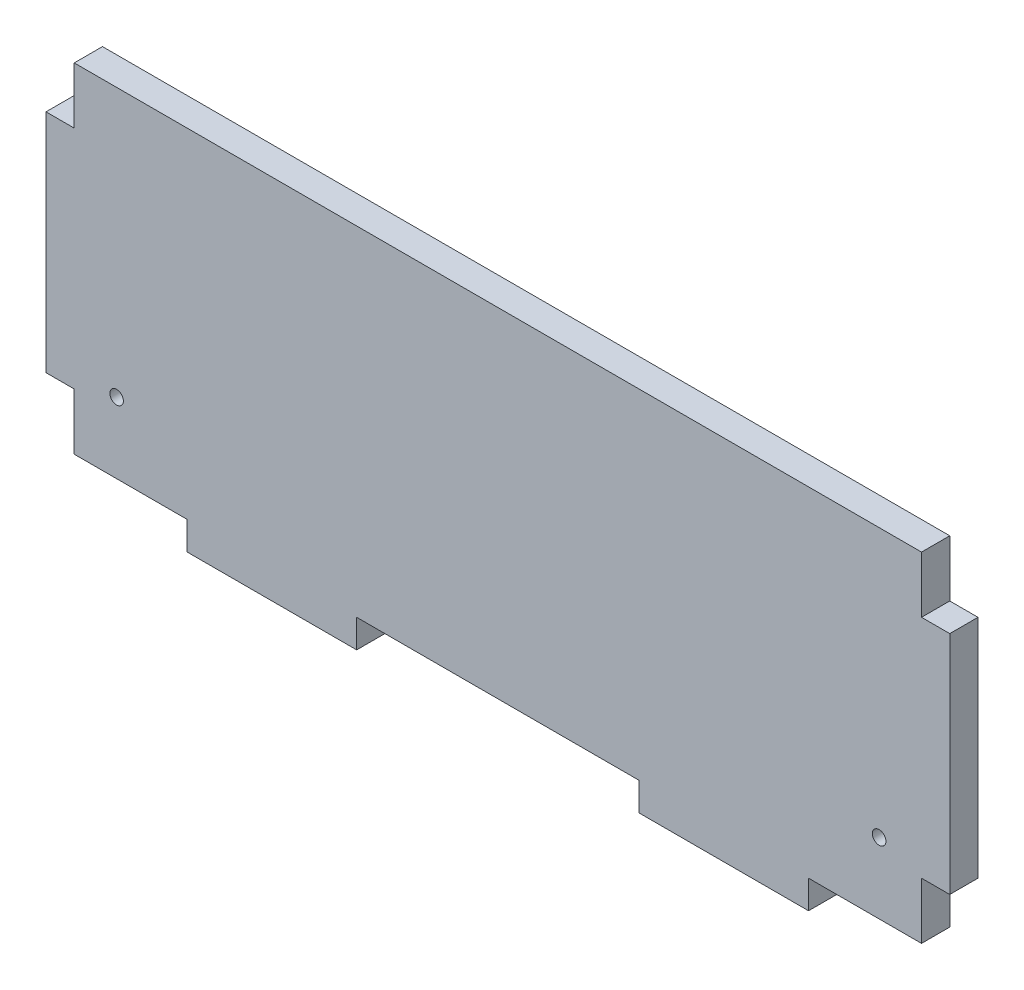
ISO-10303-21;
HEADER;
FILE_DESCRIPTION(('STEP AP214'),'2;1');
FILE_NAME('part.step','',(''),(''),'','','');
FILE_SCHEMA(('AUTOMOTIVE_DESIGN { 1 0 10303 214 1 1 1 1 }'));
ENDSEC;
DATA;
#1=APPLICATION_CONTEXT('core data for automotive mechanical design processes');
#2=APPLICATION_PROTOCOL_DEFINITION('international standard','automotive_design',2000,#1);
#3=PRODUCT_CONTEXT('',#1,'mechanical');
#4=PRODUCT('Part','Part','',(#3));
#5=PRODUCT_RELATED_PRODUCT_CATEGORY('part','',(#4));
#6=PRODUCT_DEFINITION_FORMATION('','',#4);
#7=PRODUCT_DEFINITION_CONTEXT('part definition',#1,'design');
#8=PRODUCT_DEFINITION('design','',#6,#7);
#9=PRODUCT_DEFINITION_SHAPE('','',#8);
#10=(LENGTH_UNIT() NAMED_UNIT(*) SI_UNIT(.MILLI.,.METRE.));
#11=(NAMED_UNIT(*) PLANE_ANGLE_UNIT() SI_UNIT($,.RADIAN.));
#12=(NAMED_UNIT(*) SI_UNIT($,.STERADIAN.) SOLID_ANGLE_UNIT());
#13=UNCERTAINTY_MEASURE_WITH_UNIT(LENGTH_MEASURE(1.E-05),#10,'distance_accuracy_value','');
#14=(GEOMETRIC_REPRESENTATION_CONTEXT(3) GLOBAL_UNCERTAINTY_ASSIGNED_CONTEXT((#13)) GLOBAL_UNIT_ASSIGNED_CONTEXT((#10,
#11,#12)) REPRESENTATION_CONTEXT('',''));
#15=CARTESIAN_POINT('',(0.,0.,0.));
#16=DIRECTION('',(0.,0.,1.));
#17=DIRECTION('',(1.,0.,0.));
#18=AXIS2_PLACEMENT_3D('',#15,#16,#17);
#19=CARTESIAN_POINT('',(-95.25,-38.1,6.35));
#20=DIRECTION('',(0.,1.,0.));
#21=DIRECTION('',(0.,0.,1.));
#22=AXIS2_PLACEMENT_3D('',#19,#20,#21);
#23=PLANE('',#22);
#24=DIRECTION('',(0.,0.,-1.));
#25=VECTOR('',#24,1.);
#26=CARTESIAN_POINT('',(31.75,-38.1,6.35));
#27=LINE('',#26,#25);
#28=CARTESIAN_POINT('',(31.75,-38.1,6.35));
#29=VERTEX_POINT('',#28);
#30=CARTESIAN_POINT('',(31.75,-38.1,0.));
#31=VERTEX_POINT('',#30);
#32=EDGE_CURVE('E60',#29,#31,#27,.T.);
#33=ORIENTED_EDGE('',*,*,#32,.F.);
#34=DIRECTION('',(1.,0.,0.));
#35=VECTOR('',#34,1.);
#36=CARTESIAN_POINT('',(-95.25,-38.1,6.35));
#37=LINE('',#36,#35);
#38=CARTESIAN_POINT('',(-31.75,-38.1,6.35));
#39=VERTEX_POINT('',#38);
#40=EDGE_CURVE('E395',#39,#29,#37,.T.);
#41=ORIENTED_EDGE('',*,*,#40,.F.);
#42=DIRECTION('',(0.,0.,1.));
#43=VECTOR('',#42,1.);
#44=CARTESIAN_POINT('',(-31.75,-38.1,6.35));
#45=LINE('',#44,#43);
#46=CARTESIAN_POINT('',(-31.75,-38.1,0.));
#47=VERTEX_POINT('',#46);
#48=EDGE_CURVE('E202',#47,#39,#45,.T.);
#49=ORIENTED_EDGE('',*,*,#48,.F.);
#50=DIRECTION('',(1.,0.,0.));
#51=VECTOR('',#50,1.);
#52=CARTESIAN_POINT('',(-95.25,-38.1,0.));
#53=LINE('',#52,#51);
#54=EDGE_CURVE('E232',#47,#31,#53,.T.);
#55=ORIENTED_EDGE('',*,*,#54,.T.);
#56=EDGE_LOOP('',(#33,#41,#49,#55));
#57=FACE_BOUND('',#56,.T.);
#58=ADVANCED_FACE('F35',(#57),#23,.F.);
#59=DIRECTION('',(0.,0.,1.));
#60=VECTOR('',#59,1.);
#61=CARTESIAN_POINT('',(69.85,-38.1,6.35));
#62=LINE('',#61,#60);
#63=CARTESIAN_POINT('',(69.85,-38.1,0.));
#64=VERTEX_POINT('',#63);
#65=CARTESIAN_POINT('',(69.85,-38.1,6.35));
#66=VERTEX_POINT('',#65);
#67=EDGE_CURVE('E196',#64,#66,#62,.T.);
#68=ORIENTED_EDGE('',*,*,#67,.F.);
#69=CARTESIAN_POINT('',(95.25,-38.1,0.));
#70=VERTEX_POINT('',#69);
#71=EDGE_CURVE('E230',#64,#70,#53,.T.);
#72=ORIENTED_EDGE('',*,*,#71,.T.);
#73=DIRECTION('',(0.,0.,-1.));
#74=VECTOR('',#73,1.);
#75=CARTESIAN_POINT('',(95.25,-38.1,6.35));
#76=LINE('',#75,#74);
#77=CARTESIAN_POINT('',(95.25,-38.1,6.35));
#78=VERTEX_POINT('',#77);
#79=EDGE_CURVE('E239',#78,#70,#76,.T.);
#80=ORIENTED_EDGE('',*,*,#79,.F.);
#81=EDGE_CURVE('E39',#66,#78,#37,.T.);
#82=ORIENTED_EDGE('',*,*,#81,.F.);
#83=EDGE_LOOP('',(#68,#72,#80,#82));
#84=FACE_BOUND('',#83,.T.);
#85=ADVANCED_FACE('F436',(#84),#23,.F.);
#86=DIRECTION('',(0.,0.,-1.));
#87=VECTOR('',#86,1.);
#88=CARTESIAN_POINT('',(-69.85,-38.1,6.35));
#89=LINE('',#88,#87);
#90=CARTESIAN_POINT('',(-69.85,-38.1,6.35));
#91=VERTEX_POINT('',#90);
#92=CARTESIAN_POINT('',(-69.85,-38.1,0.));
#93=VERTEX_POINT('',#92);
#94=EDGE_CURVE('E199',#91,#93,#89,.T.);
#95=ORIENTED_EDGE('',*,*,#94,.F.);
#96=CARTESIAN_POINT('',(-95.25,-38.1,6.35));
#97=VERTEX_POINT('',#96);
#98=EDGE_CURVE('E391',#97,#91,#37,.T.);
#99=ORIENTED_EDGE('',*,*,#98,.F.);
#100=DIRECTION('',(0.,0.,-1.));
#101=VECTOR('',#100,1.);
#102=CARTESIAN_POINT('',(-95.25,-38.1,6.35));
#103=LINE('',#102,#101);
#104=CARTESIAN_POINT('',(-95.25,-38.1,0.));
#105=VERTEX_POINT('',#104);
#106=EDGE_CURVE('E390',#97,#105,#103,.T.);
#107=ORIENTED_EDGE('',*,*,#106,.T.);
#108=EDGE_CURVE('E246',#105,#93,#53,.T.);
#109=ORIENTED_EDGE('',*,*,#108,.T.);
#110=EDGE_LOOP('',(#95,#99,#107,#109));
#111=FACE_BOUND('',#110,.T.);
#112=ADVANCED_FACE('F387',(#111),#23,.F.);
#113=CARTESIAN_POINT('',(95.25,-38.1,6.35));
#114=DIRECTION('',(-1.,0.,0.));
#115=DIRECTION('',(0.,0.,1.));
#116=AXIS2_PLACEMENT_3D('',#113,#114,#115);
#117=PLANE('',#116);
#118=DIRECTION('',(0.,0.,1.));
#119=VECTOR('',#118,1.);
#120=CARTESIAN_POINT('',(95.25,25.4,6.35));
#121=LINE('',#120,#119);
#122=CARTESIAN_POINT('',(95.25,25.3999999999999,0.));
#123=VERTEX_POINT('',#122);
#124=CARTESIAN_POINT('',(95.25,25.3999999999999,6.35));
#125=VERTEX_POINT('',#124);
#126=EDGE_CURVE('E261',#123,#125,#121,.T.);
#127=ORIENTED_EDGE('',*,*,#126,.F.);
#128=DIRECTION('',(0.,1.,0.));
#129=VECTOR('',#128,1.);
#130=CARTESIAN_POINT('',(95.25,-38.1,0.));
#131=LINE('',#130,#129);
#132=CARTESIAN_POINT('',(95.25,38.1,0.));
#133=VERTEX_POINT('',#132);
#134=EDGE_CURVE('E307',#123,#133,#131,.T.);
#135=ORIENTED_EDGE('',*,*,#134,.T.);
#136=DIRECTION('',(0.,0.,-1.));
#137=VECTOR('',#136,1.);
#138=CARTESIAN_POINT('',(95.25,38.1,6.35));
#139=LINE('',#138,#137);
#140=CARTESIAN_POINT('',(95.25,38.1,6.35));
#141=VERTEX_POINT('',#140);
#142=EDGE_CURVE('E11',#141,#133,#139,.T.);
#143=ORIENTED_EDGE('',*,*,#142,.F.);
#144=DIRECTION('',(0.,1.,0.));
#145=VECTOR('',#144,1.);
#146=CARTESIAN_POINT('',(95.25,-38.1,6.35));
#147=LINE('',#146,#145);
#148=EDGE_CURVE('E248',#125,#141,#147,.T.);
#149=ORIENTED_EDGE('',*,*,#148,.F.);
#150=EDGE_LOOP('',(#127,#135,#143,#149));
#151=FACE_BOUND('',#150,.T.);
#152=ADVANCED_FACE('F37',(#151),#117,.F.);
#153=DIRECTION('',(0.,0.,-1.));
#154=VECTOR('',#153,1.);
#155=CARTESIAN_POINT('',(95.25,-25.4,6.35));
#156=LINE('',#155,#154);
#157=CARTESIAN_POINT('',(95.25,-25.4,6.35));
#158=VERTEX_POINT('',#157);
#159=CARTESIAN_POINT('',(95.25,-25.4,0.));
#160=VERTEX_POINT('',#159);
#161=EDGE_CURVE('E266',#158,#160,#156,.T.);
#162=ORIENTED_EDGE('',*,*,#161,.F.);
#163=EDGE_CURVE('E345',#78,#158,#147,.T.);
#164=ORIENTED_EDGE('',*,*,#163,.F.);
#165=ORIENTED_EDGE('',*,*,#79,.T.);
#166=EDGE_CURVE('E320',#70,#160,#131,.T.);
#167=ORIENTED_EDGE('',*,*,#166,.T.);
#168=EDGE_LOOP('',(#162,#164,#165,#167));
#169=FACE_BOUND('',#168,.T.);
#170=ADVANCED_FACE('F428',(#169),#117,.F.);
#171=CARTESIAN_POINT('',(-95.25,-38.1,6.35));
#172=DIRECTION('',(1.,0.,0.));
#173=DIRECTION('',(0.,0.,-1.));
#174=AXIS2_PLACEMENT_3D('',#171,#172,#173);
#175=PLANE('',#174);
#176=DIRECTION('',(0.,0.,-1.));
#177=VECTOR('',#176,1.);
#178=CARTESIAN_POINT('',(-95.25,25.4,0.));
#179=LINE('',#178,#177);
#180=CARTESIAN_POINT('',(-95.25,25.3999999999999,6.35));
#181=VERTEX_POINT('',#180);
#182=CARTESIAN_POINT('',(-95.25,25.3999999999999,0.));
#183=VERTEX_POINT('',#182);
#184=EDGE_CURVE('E278',#181,#183,#179,.T.);
#185=ORIENTED_EDGE('',*,*,#184,.F.);
#186=DIRECTION('',(0.,-1.,0.));
#187=VECTOR('',#186,1.);
#188=CARTESIAN_POINT('',(-95.25,-38.1,6.35));
#189=LINE('',#188,#187);
#190=CARTESIAN_POINT('',(-95.25,38.1,6.35));
#191=VERTEX_POINT('',#190);
#192=EDGE_CURVE('E339',#191,#181,#189,.T.);
#193=ORIENTED_EDGE('',*,*,#192,.F.);
#194=DIRECTION('',(0.,0.,-1.));
#195=VECTOR('',#194,1.);
#196=CARTESIAN_POINT('',(-95.25,38.1,6.35));
#197=LINE('',#196,#195);
#198=CARTESIAN_POINT('',(-95.25,38.1,0.));
#199=VERTEX_POINT('',#198);
#200=EDGE_CURVE('E45',#191,#199,#197,.T.);
#201=ORIENTED_EDGE('',*,*,#200,.T.);
#202=DIRECTION('',(0.,-1.,0.));
#203=VECTOR('',#202,1.);
#204=CARTESIAN_POINT('',(-95.25,-38.1,0.));
#205=LINE('',#204,#203);
#206=EDGE_CURVE('E233',#199,#183,#205,.T.);
#207=ORIENTED_EDGE('',*,*,#206,.T.);
#208=EDGE_LOOP('',(#185,#193,#201,#207));
#209=FACE_BOUND('',#208,.T.);
#210=ADVANCED_FACE('F369',(#209),#175,.F.);
#211=DIRECTION('',(0.,0.,1.));
#212=VECTOR('',#211,1.);
#213=CARTESIAN_POINT('',(-95.25,-25.4,0.));
#214=LINE('',#213,#212);
#215=CARTESIAN_POINT('',(-95.25,-25.4,0.));
#216=VERTEX_POINT('',#215);
#217=CARTESIAN_POINT('',(-95.25,-25.4,6.35));
#218=VERTEX_POINT('',#217);
#219=EDGE_CURVE('E290',#216,#218,#214,.T.);
#220=ORIENTED_EDGE('',*,*,#219,.F.);
#221=EDGE_CURVE('E328',#216,#105,#205,.T.);
#222=ORIENTED_EDGE('',*,*,#221,.T.);
#223=ORIENTED_EDGE('',*,*,#106,.F.);
#224=EDGE_CURVE('E295',#218,#97,#189,.T.);
#225=ORIENTED_EDGE('',*,*,#224,.F.);
#226=EDGE_LOOP('',(#220,#222,#223,#225));
#227=FACE_BOUND('',#226,.T.);
#228=ADVANCED_FACE('F381',(#227),#175,.F.);
#229=CARTESIAN_POINT('',(-95.25,38.1,6.35));
#230=DIRECTION('',(0.,-1.,0.));
#231=DIRECTION('',(0.,0.,-1.));
#232=AXIS2_PLACEMENT_3D('',#229,#230,#231);
#233=PLANE('',#232);
#234=DIRECTION('',(-1.,0.,0.));
#235=VECTOR('',#234,1.);
#236=CARTESIAN_POINT('',(-95.25,38.1,0.));
#237=LINE('',#236,#235);
#238=EDGE_CURVE('E323',#133,#199,#237,.T.);
#239=ORIENTED_EDGE('',*,*,#238,.T.);
#240=ORIENTED_EDGE('',*,*,#200,.F.);
#241=DIRECTION('',(-1.,0.,0.));
#242=VECTOR('',#241,1.);
#243=CARTESIAN_POINT('',(-95.25,38.1,6.35));
#244=LINE('',#243,#242);
#245=EDGE_CURVE('E343',#141,#191,#244,.T.);
#246=ORIENTED_EDGE('',*,*,#245,.F.);
#247=ORIENTED_EDGE('',*,*,#142,.T.);
#248=EDGE_LOOP('',(#239,#240,#246,#247));
#249=FACE_BOUND('',#248,.T.);
#250=ADVANCED_FACE('F361',(#249),#233,.F.);
#251=CARTESIAN_POINT('',(0.,0.,6.35));
#252=DIRECTION('',(0.,0.,-1.));
#253=DIRECTION('',(-1.,0.,0.));
#254=AXIS2_PLACEMENT_3D('',#251,#252,#253);
#255=PLANE('',#254);
#256=CARTESIAN_POINT('',(-85.725,-22.225,6.35));
#257=DIRECTION('',(0.,0.,-1.));
#258=DIRECTION('',(-1.,0.,0.));
#259=AXIS2_PLACEMENT_3D('',#256,#257,#258);
#260=CIRCLE('',#259,1.52399999999999);
#261=CARTESIAN_POINT('',(-87.249,-22.225,6.35));
#262=VERTEX_POINT('',#261);
#263=EDGE_CURVE('E655',#262,#262,#260,.T.);
#264=ORIENTED_EDGE('',*,*,#263,.T.);
#265=EDGE_LOOP('',(#264));
#266=FACE_BOUND('',#265,.T.);
#267=CARTESIAN_POINT('',(85.725,-22.225,6.35));
#268=DIRECTION('',(0.,0.,-1.));
#269=DIRECTION('',(-1.,0.,0.));
#270=AXIS2_PLACEMENT_3D('',#267,#268,#269);
#271=CIRCLE('',#270,1.52399999999999);
#272=CARTESIAN_POINT('',(84.201,-22.225,6.35));
#273=VERTEX_POINT('',#272);
#274=EDGE_CURVE('E663',#273,#273,#271,.T.);
#275=ORIENTED_EDGE('',*,*,#274,.T.);
#276=EDGE_LOOP('',(#275));
#277=FACE_BOUND('',#276,.T.);
#278=ORIENTED_EDGE('',*,*,#163,.T.);
#279=DIRECTION('',(-1.,0.,0.));
#280=VECTOR('',#279,1.);
#281=CARTESIAN_POINT('',(101.6,-25.4,6.35));
#282=LINE('',#281,#280);
#283=CARTESIAN_POINT('',(101.6,-25.4,6.35));
#284=VERTEX_POINT('',#283);
#285=EDGE_CURVE('E294',#284,#158,#282,.T.);
#286=ORIENTED_EDGE('',*,*,#285,.F.);
#287=DIRECTION('',(0.,-1.,0.));
#288=VECTOR('',#287,1.);
#289=CARTESIAN_POINT('',(101.6,25.4,6.35));
#290=LINE('',#289,#288);
#291=CARTESIAN_POINT('',(101.6,25.4,6.35));
#292=VERTEX_POINT('',#291);
#293=EDGE_CURVE('E265',#292,#284,#290,.T.);
#294=ORIENTED_EDGE('',*,*,#293,.F.);
#295=DIRECTION('',(-1.,0.,0.));
#296=VECTOR('',#295,1.);
#297=CARTESIAN_POINT('',(101.6,25.4,6.35));
#298=LINE('',#297,#296);
#299=EDGE_CURVE('E255',#292,#125,#298,.T.);
#300=ORIENTED_EDGE('',*,*,#299,.T.);
#301=ORIENTED_EDGE('',*,*,#148,.T.);
#302=ORIENTED_EDGE('',*,*,#245,.T.);
#303=ORIENTED_EDGE('',*,*,#192,.T.);
#304=DIRECTION('',(1.,0.,0.));
#305=VECTOR('',#304,1.);
#306=CARTESIAN_POINT('',(-101.6,25.4,6.35));
#307=LINE('',#306,#305);
#308=CARTESIAN_POINT('',(-101.6,25.4,6.35));
#309=VERTEX_POINT('',#308);
#310=EDGE_CURVE('E302',#309,#181,#307,.T.);
#311=ORIENTED_EDGE('',*,*,#310,.F.);
#312=DIRECTION('',(0.,1.,0.));
#313=VECTOR('',#312,1.);
#314=CARTESIAN_POINT('',(-101.6,25.4,6.35));
#315=LINE('',#314,#313);
#316=CARTESIAN_POINT('',(-101.6,-25.4,6.35));
#317=VERTEX_POINT('',#316);
#318=EDGE_CURVE('E280',#317,#309,#315,.T.);
#319=ORIENTED_EDGE('',*,*,#318,.F.);
#320=DIRECTION('',(1.,0.,0.));
#321=VECTOR('',#320,1.);
#322=CARTESIAN_POINT('',(-101.6,-25.4,6.35));
#323=LINE('',#322,#321);
#324=EDGE_CURVE('E298',#317,#218,#323,.T.);
#325=ORIENTED_EDGE('',*,*,#324,.T.);
#326=ORIENTED_EDGE('',*,*,#224,.T.);
#327=ORIENTED_EDGE('',*,*,#98,.T.);
#328=DIRECTION('',(0.,1.,0.));
#329=VECTOR('',#328,1.);
#330=CARTESIAN_POINT('',(-69.85,-44.45,6.35));
#331=LINE('',#330,#329);
#332=CARTESIAN_POINT('',(-69.85,-44.45,6.35));
#333=VERTEX_POINT('',#332);
#334=EDGE_CURVE('E217',#333,#91,#331,.T.);
#335=ORIENTED_EDGE('',*,*,#334,.F.);
#336=DIRECTION('',(-1.,0.,0.));
#337=VECTOR('',#336,1.);
#338=CARTESIAN_POINT('',(-69.85,-44.45,6.35));
#339=LINE('',#338,#337);
#340=CARTESIAN_POINT('',(-31.75,-44.45,6.35));
#341=VERTEX_POINT('',#340);
#342=EDGE_CURVE('E215',#341,#333,#339,.T.);
#343=ORIENTED_EDGE('',*,*,#342,.F.);
#344=DIRECTION('',(0.,1.,0.));
#345=VECTOR('',#344,1.);
#346=CARTESIAN_POINT('',(-31.75,-44.45,6.35));
#347=LINE('',#346,#345);
#348=EDGE_CURVE('E228',#341,#39,#347,.T.);
#349=ORIENTED_EDGE('',*,*,#348,.T.);
#350=ORIENTED_EDGE('',*,*,#40,.T.);
#351=DIRECTION('',(0.,1.,0.));
#352=VECTOR('',#351,1.);
#353=CARTESIAN_POINT('',(31.75,-44.45,6.35));
#354=LINE('',#353,#352);
#355=CARTESIAN_POINT('',(31.75,-44.45,6.35));
#356=VERTEX_POINT('',#355);
#357=EDGE_CURVE('E670',#356,#29,#354,.T.);
#358=ORIENTED_EDGE('',*,*,#357,.F.);
#359=DIRECTION('',(-1.,0.,0.));
#360=VECTOR('',#359,1.);
#361=CARTESIAN_POINT('',(31.75,-44.45,6.35));
#362=LINE('',#361,#360);
#363=CARTESIAN_POINT('',(69.85,-44.45,6.35));
#364=VERTEX_POINT('',#363);
#365=EDGE_CURVE('E192',#364,#356,#362,.T.);
#366=ORIENTED_EDGE('',*,*,#365,.F.);
#367=DIRECTION('',(0.,1.,0.));
#368=VECTOR('',#367,1.);
#369=CARTESIAN_POINT('',(69.85,-44.45,6.35));
#370=LINE('',#369,#368);
#371=EDGE_CURVE('E204',#364,#66,#370,.T.);
#372=ORIENTED_EDGE('',*,*,#371,.T.);
#373=ORIENTED_EDGE('',*,*,#81,.T.);
#374=EDGE_LOOP('',(#278,#286,#294,#300,#301,#302,#303,#311,#319,#325,#326,#327,#335,#343,#349,
#350,#358,#366,#372,#373));
#375=FACE_BOUND('',#374,.T.);
#376=ADVANCED_FACE('F356',(#266,#277,#375),#255,.F.);
#377=CARTESIAN_POINT('',(0.,0.,0.));
#378=DIRECTION('',(0.,0.,-1.));
#379=DIRECTION('',(-1.,0.,0.));
#380=AXIS2_PLACEMENT_3D('',#377,#378,#379);
#381=PLANE('',#380);
#382=CARTESIAN_POINT('',(-85.725,-22.225,0.));
#383=DIRECTION('',(0.,0.,-1.));
#384=DIRECTION('',(-1.,0.,0.));
#385=AXIS2_PLACEMENT_3D('',#382,#383,#384);
#386=CIRCLE('',#385,1.52399999999999);
#387=CARTESIAN_POINT('',(-87.249,-22.225,0.));
#388=VERTEX_POINT('',#387);
#389=EDGE_CURVE('E658',#388,#388,#386,.T.);
#390=ORIENTED_EDGE('',*,*,#389,.F.);
#391=EDGE_LOOP('',(#390));
#392=FACE_BOUND('',#391,.T.);
#393=CARTESIAN_POINT('',(85.725,-22.225,0.));
#394=DIRECTION('',(0.,0.,-1.));
#395=DIRECTION('',(-1.,0.,0.));
#396=AXIS2_PLACEMENT_3D('',#393,#394,#395);
#397=CIRCLE('',#396,1.52399999999999);
#398=CARTESIAN_POINT('',(84.201,-22.225,0.));
#399=VERTEX_POINT('',#398);
#400=EDGE_CURVE('E660',#399,#399,#397,.T.);
#401=ORIENTED_EDGE('',*,*,#400,.F.);
#402=EDGE_LOOP('',(#401));
#403=FACE_BOUND('',#402,.T.);
#404=ORIENTED_EDGE('',*,*,#166,.F.);
#405=ORIENTED_EDGE('',*,*,#71,.F.);
#406=DIRECTION('',(0.,1.,0.));
#407=VECTOR('',#406,1.);
#408=CARTESIAN_POINT('',(69.85,-44.45,0.));
#409=LINE('',#408,#407);
#410=CARTESIAN_POINT('',(69.85,-44.45,0.));
#411=VERTEX_POINT('',#410);
#412=EDGE_CURVE('E183',#411,#64,#409,.T.);
#413=ORIENTED_EDGE('',*,*,#412,.F.);
#414=DIRECTION('',(1.,0.,0.));
#415=VECTOR('',#414,1.);
#416=CARTESIAN_POINT('',(31.75,-44.45,0.));
#417=LINE('',#416,#415);
#418=CARTESIAN_POINT('',(31.75,-44.45,0.));
#419=VERTEX_POINT('',#418);
#420=EDGE_CURVE('E175',#419,#411,#417,.T.);
#421=ORIENTED_EDGE('',*,*,#420,.F.);
#422=DIRECTION('',(0.,1.,0.));
#423=VECTOR('',#422,1.);
#424=CARTESIAN_POINT('',(31.75,-44.45,0.));
#425=LINE('',#424,#423);
#426=EDGE_CURVE('E181',#419,#31,#425,.T.);
#427=ORIENTED_EDGE('',*,*,#426,.T.);
#428=ORIENTED_EDGE('',*,*,#54,.F.);
#429=DIRECTION('',(0.,1.,0.));
#430=VECTOR('',#429,1.);
#431=CARTESIAN_POINT('',(-31.75,-44.45,0.));
#432=LINE('',#431,#430);
#433=CARTESIAN_POINT('',(-31.75,-44.45,0.));
#434=VERTEX_POINT('',#433);
#435=EDGE_CURVE('E403',#434,#47,#432,.T.);
#436=ORIENTED_EDGE('',*,*,#435,.F.);
#437=DIRECTION('',(1.,0.,0.));
#438=VECTOR('',#437,1.);
#439=CARTESIAN_POINT('',(-69.85,-44.45,0.));
#440=LINE('',#439,#438);
#441=CARTESIAN_POINT('',(-69.85,-44.45,0.));
#442=VERTEX_POINT('',#441);
#443=EDGE_CURVE('E211',#442,#434,#440,.T.);
#444=ORIENTED_EDGE('',*,*,#443,.F.);
#445=DIRECTION('',(0.,1.,0.));
#446=VECTOR('',#445,1.);
#447=CARTESIAN_POINT('',(-69.85,-44.45,0.));
#448=LINE('',#447,#446);
#449=EDGE_CURVE('E385',#442,#93,#448,.T.);
#450=ORIENTED_EDGE('',*,*,#449,.T.);
#451=ORIENTED_EDGE('',*,*,#108,.F.);
#452=ORIENTED_EDGE('',*,*,#221,.F.);
#453=DIRECTION('',(1.,0.,0.));
#454=VECTOR('',#453,1.);
#455=CARTESIAN_POINT('',(-101.6,-25.4,0.));
#456=LINE('',#455,#454);
#457=CARTESIAN_POINT('',(-101.6,-25.4,0.));
#458=VERTEX_POINT('',#457);
#459=EDGE_CURVE('E301',#458,#216,#456,.T.);
#460=ORIENTED_EDGE('',*,*,#459,.F.);
#461=DIRECTION('',(0.,-1.,0.));
#462=VECTOR('',#461,1.);
#463=CARTESIAN_POINT('',(-101.6,25.4,0.));
#464=LINE('',#463,#462);
#465=CARTESIAN_POINT('',(-101.6,25.4,0.));
#466=VERTEX_POINT('',#465);
#467=EDGE_CURVE('E274',#466,#458,#464,.T.);
#468=ORIENTED_EDGE('',*,*,#467,.F.);
#469=DIRECTION('',(1.,0.,0.));
#470=VECTOR('',#469,1.);
#471=CARTESIAN_POINT('',(-101.6,25.4,0.));
#472=LINE('',#471,#470);
#473=EDGE_CURVE('E284',#466,#183,#472,.T.);
#474=ORIENTED_EDGE('',*,*,#473,.T.);
#475=ORIENTED_EDGE('',*,*,#206,.F.);
#476=ORIENTED_EDGE('',*,*,#238,.F.);
#477=ORIENTED_EDGE('',*,*,#134,.F.);
#478=DIRECTION('',(-1.,0.,0.));
#479=VECTOR('',#478,1.);
#480=CARTESIAN_POINT('',(101.6,25.4,0.));
#481=LINE('',#480,#479);
#482=CARTESIAN_POINT('',(101.6,25.4,0.));
#483=VERTEX_POINT('',#482);
#484=EDGE_CURVE('E251',#483,#123,#481,.T.);
#485=ORIENTED_EDGE('',*,*,#484,.F.);
#486=DIRECTION('',(0.,1.,0.));
#487=VECTOR('',#486,1.);
#488=CARTESIAN_POINT('',(101.6,25.4,0.));
#489=LINE('',#488,#487);
#490=CARTESIAN_POINT('',(101.6,-25.4,0.));
#491=VERTEX_POINT('',#490);
#492=EDGE_CURVE('E420',#491,#483,#489,.T.);
#493=ORIENTED_EDGE('',*,*,#492,.F.);
#494=DIRECTION('',(-1.,0.,0.));
#495=VECTOR('',#494,1.);
#496=CARTESIAN_POINT('',(101.6,-25.4,0.));
#497=LINE('',#496,#495);
#498=EDGE_CURVE('E254',#491,#160,#497,.T.);
#499=ORIENTED_EDGE('',*,*,#498,.T.);
#500=EDGE_LOOP('',(#404,#405,#413,#421,#427,#428,#436,#444,#450,#451,#452,#460,#468,#474,#475,
#476,#477,#485,#493,#499));
#501=FACE_BOUND('',#500,.T.);
#502=ADVANCED_FACE('F178',(#392,#403,#501),#381,.T.);
#503=CARTESIAN_POINT('',(-101.6,-25.4,0.));
#504=DIRECTION('',(0.,1.,0.));
#505=DIRECTION('',(0.,0.,1.));
#506=AXIS2_PLACEMENT_3D('',#503,#504,#505);
#507=PLANE('',#506);
#508=ORIENTED_EDGE('',*,*,#219,.T.);
#509=ORIENTED_EDGE('',*,*,#324,.F.);
#510=DIRECTION('',(0.,0.,1.));
#511=VECTOR('',#510,1.);
#512=CARTESIAN_POINT('',(-101.6,-25.4,0.));
#513=LINE('',#512,#511);
#514=EDGE_CURVE('E277',#458,#317,#513,.T.);
#515=ORIENTED_EDGE('',*,*,#514,.F.);
#516=ORIENTED_EDGE('',*,*,#459,.T.);
#517=EDGE_LOOP('',(#508,#509,#515,#516));
#518=FACE_BOUND('',#517,.T.);
#519=ADVANCED_FACE('F380',(#518),#507,.F.);
#520=CARTESIAN_POINT('',(-101.6,25.4,0.));
#521=DIRECTION('',(0.,-1.,0.));
#522=DIRECTION('',(0.,0.,-1.));
#523=AXIS2_PLACEMENT_3D('',#520,#521,#522);
#524=PLANE('',#523);
#525=ORIENTED_EDGE('',*,*,#184,.T.);
#526=ORIENTED_EDGE('',*,*,#473,.F.);
#527=DIRECTION('',(0.,0.,-1.));
#528=VECTOR('',#527,1.);
#529=CARTESIAN_POINT('',(-101.6,25.4,0.));
#530=LINE('',#529,#528);
#531=EDGE_CURVE('E282',#309,#466,#530,.T.);
#532=ORIENTED_EDGE('',*,*,#531,.F.);
#533=ORIENTED_EDGE('',*,*,#310,.T.);
#534=EDGE_LOOP('',(#525,#526,#532,#533));
#535=FACE_BOUND('',#534,.T.);
#536=ADVANCED_FACE('F371',(#535),#524,.F.);
#537=CARTESIAN_POINT('',(-101.6,0.,0.));
#538=DIRECTION('',(-1.,0.,0.));
#539=DIRECTION('',(0.,0.,1.));
#540=AXIS2_PLACEMENT_3D('',#537,#538,#539);
#541=PLANE('',#540);
#542=ORIENTED_EDGE('',*,*,#467,.T.);
#543=ORIENTED_EDGE('',*,*,#514,.T.);
#544=ORIENTED_EDGE('',*,*,#318,.T.);
#545=ORIENTED_EDGE('',*,*,#531,.T.);
#546=EDGE_LOOP('',(#542,#543,#544,#545));
#547=FACE_BOUND('',#546,.T.);
#548=ADVANCED_FACE('F377',(#547),#541,.T.);
#549=CARTESIAN_POINT('',(101.6,-25.4,6.35));
#550=DIRECTION('',(0.,1.,0.));
#551=DIRECTION('',(0.,0.,1.));
#552=AXIS2_PLACEMENT_3D('',#549,#550,#551);
#553=PLANE('',#552);
#554=ORIENTED_EDGE('',*,*,#161,.T.);
#555=ORIENTED_EDGE('',*,*,#498,.F.);
#556=DIRECTION('',(0.,0.,-1.));
#557=VECTOR('',#556,1.);
#558=CARTESIAN_POINT('',(101.6,-25.4,6.35));
#559=LINE('',#558,#557);
#560=EDGE_CURVE('E417',#284,#491,#559,.T.);
#561=ORIENTED_EDGE('',*,*,#560,.F.);
#562=ORIENTED_EDGE('',*,*,#285,.T.);
#563=EDGE_LOOP('',(#554,#555,#561,#562));
#564=FACE_BOUND('',#563,.T.);
#565=ADVANCED_FACE('F416',(#564),#553,.F.);
#566=CARTESIAN_POINT('',(101.6,25.4,6.35));
#567=DIRECTION('',(0.,-1.,0.));
#568=DIRECTION('',(0.,0.,-1.));
#569=AXIS2_PLACEMENT_3D('',#566,#567,#568);
#570=PLANE('',#569);
#571=ORIENTED_EDGE('',*,*,#126,.T.);
#572=ORIENTED_EDGE('',*,*,#299,.F.);
#573=DIRECTION('',(0.,0.,1.));
#574=VECTOR('',#573,1.);
#575=CARTESIAN_POINT('',(101.6,25.4,6.35));
#576=LINE('',#575,#574);
#577=EDGE_CURVE('E260',#483,#292,#576,.T.);
#578=ORIENTED_EDGE('',*,*,#577,.F.);
#579=ORIENTED_EDGE('',*,*,#484,.T.);
#580=EDGE_LOOP('',(#571,#572,#578,#579));
#581=FACE_BOUND('',#580,.T.);
#582=ADVANCED_FACE('F427',(#581),#570,.F.);
#583=CARTESIAN_POINT('',(101.6,0.,0.));
#584=DIRECTION('',(1.,0.,0.));
#585=DIRECTION('',(0.,0.,-1.));
#586=AXIS2_PLACEMENT_3D('',#583,#584,#585);
#587=PLANE('',#586);
#588=ORIENTED_EDGE('',*,*,#293,.T.);
#589=ORIENTED_EDGE('',*,*,#560,.T.);
#590=ORIENTED_EDGE('',*,*,#492,.T.);
#591=ORIENTED_EDGE('',*,*,#577,.T.);
#592=EDGE_LOOP('',(#588,#589,#590,#591));
#593=FACE_BOUND('',#592,.T.);
#594=ADVANCED_FACE('F424',(#593),#587,.T.);
#595=CARTESIAN_POINT('',(-69.85,-44.45,6.35));
#596=DIRECTION('',(1.,0.,0.));
#597=DIRECTION('',(0.,0.,-1.));
#598=AXIS2_PLACEMENT_3D('',#595,#596,#597);
#599=PLANE('',#598);
#600=ORIENTED_EDGE('',*,*,#94,.T.);
#601=ORIENTED_EDGE('',*,*,#449,.F.);
#602=DIRECTION('',(0.,0.,-1.));
#603=VECTOR('',#602,1.);
#604=CARTESIAN_POINT('',(-69.85,-44.45,6.35));
#605=LINE('',#604,#603);
#606=EDGE_CURVE('E208',#333,#442,#605,.T.);
#607=ORIENTED_EDGE('',*,*,#606,.F.);
#608=ORIENTED_EDGE('',*,*,#334,.T.);
#609=EDGE_LOOP('',(#600,#601,#607,#608));
#610=FACE_BOUND('',#609,.T.);
#611=ADVANCED_FACE('F487',(#610),#599,.F.);
#612=CARTESIAN_POINT('',(-31.75,-44.45,6.35));
#613=DIRECTION('',(-1.,0.,0.));
#614=DIRECTION('',(0.,0.,1.));
#615=AXIS2_PLACEMENT_3D('',#612,#613,#614);
#616=PLANE('',#615);
#617=ORIENTED_EDGE('',*,*,#48,.T.);
#618=ORIENTED_EDGE('',*,*,#348,.F.);
#619=DIRECTION('',(0.,0.,1.));
#620=VECTOR('',#619,1.);
#621=CARTESIAN_POINT('',(-31.75,-44.45,6.35));
#622=LINE('',#621,#620);
#623=EDGE_CURVE('E213',#434,#341,#622,.T.);
#624=ORIENTED_EDGE('',*,*,#623,.F.);
#625=ORIENTED_EDGE('',*,*,#435,.T.);
#626=EDGE_LOOP('',(#617,#618,#624,#625));
#627=FACE_BOUND('',#626,.T.);
#628=ADVANCED_FACE('F536',(#627),#616,.F.);
#629=CARTESIAN_POINT('',(0.,-44.45,0.));
#630=DIRECTION('',(0.,-1.,0.));
#631=DIRECTION('',(0.,0.,-1.));
#632=AXIS2_PLACEMENT_3D('',#629,#630,#631);
#633=PLANE('',#632);
#634=ORIENTED_EDGE('',*,*,#606,.T.);
#635=ORIENTED_EDGE('',*,*,#443,.T.);
#636=ORIENTED_EDGE('',*,*,#623,.T.);
#637=ORIENTED_EDGE('',*,*,#342,.T.);
#638=EDGE_LOOP('',(#634,#635,#636,#637));
#639=FACE_BOUND('',#638,.T.);
#640=ADVANCED_FACE('F545',(#639),#633,.T.);
#641=CARTESIAN_POINT('',(31.75,-44.45,6.35));
#642=DIRECTION('',(1.,0.,0.));
#643=DIRECTION('',(0.,0.,-1.));
#644=AXIS2_PLACEMENT_3D('',#641,#642,#643);
#645=PLANE('',#644);
#646=ORIENTED_EDGE('',*,*,#32,.T.);
#647=ORIENTED_EDGE('',*,*,#426,.F.);
#648=DIRECTION('',(0.,0.,-1.));
#649=VECTOR('',#648,1.);
#650=CARTESIAN_POINT('',(31.75,-44.45,6.35));
#651=LINE('',#650,#649);
#652=EDGE_CURVE('E187',#356,#419,#651,.T.);
#653=ORIENTED_EDGE('',*,*,#652,.F.);
#654=ORIENTED_EDGE('',*,*,#357,.T.);
#655=EDGE_LOOP('',(#646,#647,#653,#654));
#656=FACE_BOUND('',#655,.T.);
#657=ADVANCED_FACE('F198',(#656),#645,.F.);
#658=CARTESIAN_POINT('',(69.85,-44.45,6.35));
#659=DIRECTION('',(-1.,0.,0.));
#660=DIRECTION('',(0.,0.,1.));
#661=AXIS2_PLACEMENT_3D('',#658,#659,#660);
#662=PLANE('',#661);
#663=ORIENTED_EDGE('',*,*,#67,.T.);
#664=ORIENTED_EDGE('',*,*,#371,.F.);
#665=DIRECTION('',(0.,0.,1.));
#666=VECTOR('',#665,1.);
#667=CARTESIAN_POINT('',(69.85,-44.45,6.35));
#668=LINE('',#667,#666);
#669=EDGE_CURVE('E186',#411,#364,#668,.T.);
#670=ORIENTED_EDGE('',*,*,#669,.F.);
#671=ORIENTED_EDGE('',*,*,#412,.T.);
#672=EDGE_LOOP('',(#663,#664,#670,#671));
#673=FACE_BOUND('',#672,.T.);
#674=ADVANCED_FACE('F562',(#673),#662,.F.);
#675=CARTESIAN_POINT('',(0.,-44.45,0.));
#676=DIRECTION('',(0.,-1.,0.));
#677=DIRECTION('',(0.,0.,-1.));
#678=AXIS2_PLACEMENT_3D('',#675,#676,#677);
#679=PLANE('',#678);
#680=ORIENTED_EDGE('',*,*,#652,.T.);
#681=ORIENTED_EDGE('',*,*,#420,.T.);
#682=ORIENTED_EDGE('',*,*,#669,.T.);
#683=ORIENTED_EDGE('',*,*,#365,.T.);
#684=EDGE_LOOP('',(#680,#681,#682,#683));
#685=FACE_BOUND('',#684,.T.);
#686=ADVANCED_FACE('F190',(#685),#679,.T.);
#687=CARTESIAN_POINT('',(85.725,-22.225,6.35));
#688=DIRECTION('',(0.,0.,-1.));
#689=DIRECTION('',(-1.,0.,0.));
#690=AXIS2_PLACEMENT_3D('',#687,#688,#689);
#691=CYLINDRICAL_SURFACE('',#690,1.52399999999999);
#692=ORIENTED_EDGE('',*,*,#274,.F.);
#693=EDGE_LOOP('',(#692));
#694=FACE_BOUND('',#693,.T.);
#695=ORIENTED_EDGE('',*,*,#400,.T.);
#696=EDGE_LOOP('',(#695));
#697=FACE_BOUND('',#696,.T.);
#698=ADVANCED_FACE('F578',(#694,#697),#691,.F.);
#699=CARTESIAN_POINT('',(-85.725,-22.225,6.35));
#700=DIRECTION('',(0.,0.,-1.));
#701=DIRECTION('',(-1.,0.,0.));
#702=AXIS2_PLACEMENT_3D('',#699,#700,#701);
#703=CYLINDRICAL_SURFACE('',#702,1.52399999999999);
#704=ORIENTED_EDGE('',*,*,#263,.F.);
#705=EDGE_LOOP('',(#704));
#706=FACE_BOUND('',#705,.T.);
#707=ORIENTED_EDGE('',*,*,#389,.T.);
#708=EDGE_LOOP('',(#707));
#709=FACE_BOUND('',#708,.T.);
#710=ADVANCED_FACE('F586',(#706,#709),#703,.F.);
#711=CLOSED_SHELL('',(#58,#85,#112,#152,#170,#210,#228,#250,#376,#502,#519,#536,#548,#565,#582,
#594,#611,#628,#640,#657,#674,#686,#698,#710));
#712=MANIFOLD_SOLID_BREP('B2',#711);
#713=ADVANCED_BREP_SHAPE_REPRESENTATION('',(#18,#712),#14);
#714=SHAPE_DEFINITION_REPRESENTATION(#9,#713);
ENDSEC;
END-ISO-10303-21;
